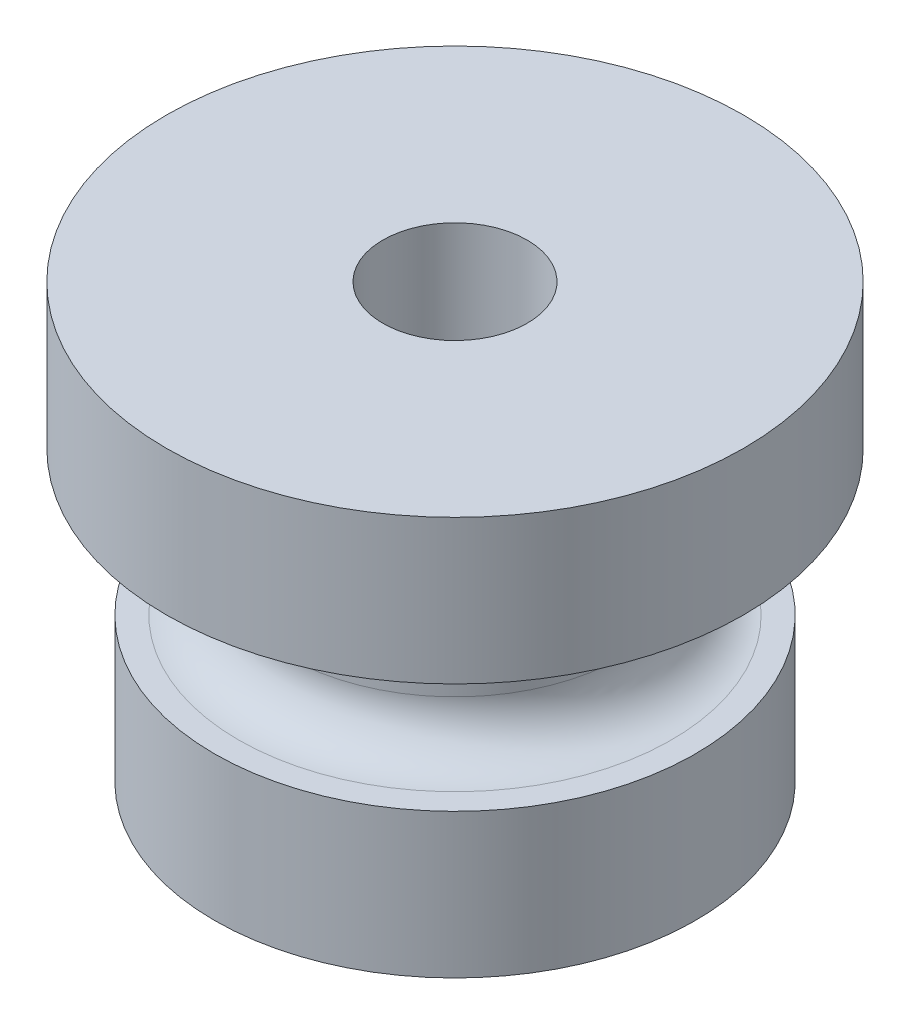
ISO-10303-21;
HEADER;
FILE_DESCRIPTION(('STEP AP214'),'2;1');
FILE_NAME('part.step','',(''),(''),'','','');
FILE_SCHEMA(('AUTOMOTIVE_DESIGN { 1 0 10303 214 1 1 1 1 }'));
ENDSEC;
DATA;
#1=APPLICATION_CONTEXT('core data for automotive mechanical design processes');
#2=APPLICATION_PROTOCOL_DEFINITION('international standard','automotive_design',2000,#1);
#3=PRODUCT_CONTEXT('',#1,'mechanical');
#4=PRODUCT('Part','Part','',(#3));
#5=PRODUCT_RELATED_PRODUCT_CATEGORY('part','',(#4));
#6=PRODUCT_DEFINITION_FORMATION('','',#4);
#7=PRODUCT_DEFINITION_CONTEXT('part definition',#1,'design');
#8=PRODUCT_DEFINITION('design','',#6,#7);
#9=PRODUCT_DEFINITION_SHAPE('','',#8);
#10=(LENGTH_UNIT() NAMED_UNIT(*) SI_UNIT(.MILLI.,.METRE.));
#11=(NAMED_UNIT(*) PLANE_ANGLE_UNIT() SI_UNIT($,.RADIAN.));
#12=(NAMED_UNIT(*) SI_UNIT($,.STERADIAN.) SOLID_ANGLE_UNIT());
#13=UNCERTAINTY_MEASURE_WITH_UNIT(LENGTH_MEASURE(1.E-05),#10,'distance_accuracy_value','');
#14=(GEOMETRIC_REPRESENTATION_CONTEXT(3) GLOBAL_UNCERTAINTY_ASSIGNED_CONTEXT((#13)) GLOBAL_UNIT_ASSIGNED_CONTEXT((#10,
#11,#12)) REPRESENTATION_CONTEXT('',''));
#15=CARTESIAN_POINT('',(0.,0.,0.));
#16=DIRECTION('',(0.,0.,1.));
#17=DIRECTION('',(1.,0.,0.));
#18=AXIS2_PLACEMENT_3D('',#15,#16,#17);
#19=CARTESIAN_POINT('',(0.,9.,0.));
#20=DIRECTION('',(0.,-1.,0.));
#21=DIRECTION('',(0.,0.,1.));
#22=AXIS2_PLACEMENT_3D('',#19,#20,#21);
#23=CYLINDRICAL_SURFACE('',#22,3.5);
#24=CARTESIAN_POINT('',(0.,4.,0.));
#25=DIRECTION('',(0.,1.,0.));
#26=DIRECTION('',(0.,0.,1.));
#27=AXIS2_PLACEMENT_3D('',#24,#25,#26);
#28=CIRCLE('',#27,3.5);
#29=CARTESIAN_POINT('',(0.,4.,3.5));
#30=VERTEX_POINT('',#29);
#31=EDGE_CURVE('E46',#30,#30,#28,.F.);
#32=ORIENTED_EDGE('',*,*,#31,.F.);
#33=EDGE_LOOP('',(#32));
#34=FACE_BOUND('',#33,.T.);
#35=CARTESIAN_POINT('',(0.,5.,0.));
#36=DIRECTION('',(0.,-1.,0.));
#37=DIRECTION('',(0.,0.,-1.));
#38=AXIS2_PLACEMENT_3D('',#35,#36,#37);
#39=CIRCLE('',#38,3.5);
#40=CARTESIAN_POINT('',(0.,5.,-3.5));
#41=VERTEX_POINT('',#40);
#42=EDGE_CURVE('E50',#41,#41,#39,.F.);
#43=ORIENTED_EDGE('',*,*,#42,.F.);
#44=EDGE_LOOP('',(#43));
#45=FACE_BOUND('',#44,.T.);
#46=ADVANCED_FACE('F39',(#34,#45),#23,.T.);
#47=CARTESIAN_POINT('',(0.,9.,0.));
#48=DIRECTION('',(0.,1.,0.));
#49=DIRECTION('',(0.,0.,-1.));
#50=AXIS2_PLACEMENT_3D('',#47,#48,#49);
#51=PLANE('',#50);
#52=CARTESIAN_POINT('',(0.,9.,0.));
#53=DIRECTION('',(0.,-1.,0.));
#54=DIRECTION('',(0.,0.,-1.));
#55=AXIS2_PLACEMENT_3D('',#52,#53,#54);
#56=CIRCLE('',#55,1.5);
#57=CARTESIAN_POINT('',(0.,9.,-1.5));
#58=VERTEX_POINT('',#57);
#59=EDGE_CURVE('E59',#58,#58,#56,.T.);
#60=ORIENTED_EDGE('',*,*,#59,.T.);
#61=EDGE_LOOP('',(#60));
#62=FACE_BOUND('',#61,.T.);
#63=CARTESIAN_POINT('',(0.,9.,0.));
#64=DIRECTION('',(0.,-1.,0.));
#65=DIRECTION('',(0.,0.,-1.));
#66=AXIS2_PLACEMENT_3D('',#63,#64,#65);
#67=CIRCLE('',#66,6.);
#68=CARTESIAN_POINT('',(0.,9.,-6.));
#69=VERTEX_POINT('',#68);
#70=EDGE_CURVE('E66',#69,#69,#67,.T.);
#71=ORIENTED_EDGE('',*,*,#70,.F.);
#72=EDGE_LOOP('',(#71));
#73=FACE_BOUND('',#72,.T.);
#74=ADVANCED_FACE('F90',(#62,#73),#51,.T.);
#75=CARTESIAN_POINT('',(0.,0.,0.));
#76=DIRECTION('',(0.,1.,0.));
#77=DIRECTION('',(0.,0.,-1.));
#78=AXIS2_PLACEMENT_3D('',#75,#76,#77);
#79=PLANE('',#78);
#80=CARTESIAN_POINT('',(0.,0.,0.));
#81=DIRECTION('',(0.,-1.,0.));
#82=DIRECTION('',(0.,0.,-1.));
#83=AXIS2_PLACEMENT_3D('',#80,#81,#82);
#84=CIRCLE('',#83,1.5);
#85=CARTESIAN_POINT('',(0.,0.,-1.5));
#86=VERTEX_POINT('',#85);
#87=EDGE_CURVE('E60',#86,#86,#84,.T.);
#88=ORIENTED_EDGE('',*,*,#87,.F.);
#89=EDGE_LOOP('',(#88));
#90=FACE_BOUND('',#89,.T.);
#91=CARTESIAN_POINT('',(0.,0.,0.));
#92=DIRECTION('',(0.,1.,0.));
#93=DIRECTION('',(0.,0.,1.));
#94=AXIS2_PLACEMENT_3D('',#91,#92,#93);
#95=CIRCLE('',#94,5.);
#96=CARTESIAN_POINT('',(0.,0.,5.));
#97=VERTEX_POINT('',#96);
#98=EDGE_CURVE('E72',#97,#97,#95,.T.);
#99=ORIENTED_EDGE('',*,*,#98,.F.);
#100=EDGE_LOOP('',(#99));
#101=FACE_BOUND('',#100,.T.);
#102=ADVANCED_FACE('F87',(#90,#101),#79,.F.);
#103=CARTESIAN_POINT('',(0.,9.,0.));
#104=DIRECTION('',(0.,-1.,0.));
#105=DIRECTION('',(0.,0.,1.));
#106=AXIS2_PLACEMENT_3D('',#103,#104,#105);
#107=CYLINDRICAL_SURFACE('',#106,1.5);
#108=ORIENTED_EDGE('',*,*,#87,.T.);
#109=EDGE_LOOP('',(#108));
#110=FACE_BOUND('',#109,.T.);
#111=ORIENTED_EDGE('',*,*,#59,.F.);
#112=EDGE_LOOP('',(#111));
#113=FACE_BOUND('',#112,.T.);
#114=ADVANCED_FACE('F89',(#110,#113),#107,.F.);
#115=CARTESIAN_POINT('',(0.,6.,0.));
#116=DIRECTION('',(0.,1.,0.));
#117=DIRECTION('',(0.,0.,-1.));
#118=AXIS2_PLACEMENT_3D('',#115,#116,#117);
#119=PLANE('',#118);
#120=CARTESIAN_POINT('',(0.,6.,0.));
#121=DIRECTION('',(0.,-1.,0.));
#122=DIRECTION('',(0.,0.,-1.));
#123=AXIS2_PLACEMENT_3D('',#120,#121,#122);
#124=CIRCLE('',#123,4.5);
#125=CARTESIAN_POINT('',(0.,6.,-4.5));
#126=VERTEX_POINT('',#125);
#127=EDGE_CURVE('E10',#126,#126,#124,.T.);
#128=ORIENTED_EDGE('',*,*,#127,.F.);
#129=EDGE_LOOP('',(#128));
#130=FACE_BOUND('',#129,.T.);
#131=CARTESIAN_POINT('',(0.,6.,0.));
#132=DIRECTION('',(0.,-1.,0.));
#133=DIRECTION('',(0.,0.,-1.));
#134=AXIS2_PLACEMENT_3D('',#131,#132,#133);
#135=CIRCLE('',#134,6.);
#136=CARTESIAN_POINT('',(0.,6.,-6.));
#137=VERTEX_POINT('',#136);
#138=EDGE_CURVE('E63',#137,#137,#135,.T.);
#139=ORIENTED_EDGE('',*,*,#138,.T.);
#140=EDGE_LOOP('',(#139));
#141=FACE_BOUND('',#140,.T.);
#142=ADVANCED_FACE('F97',(#130,#141),#119,.F.);
#143=CARTESIAN_POINT('',(0.,6.,0.));
#144=DIRECTION('',(0.,1.,0.));
#145=DIRECTION('',(0.,0.,-1.));
#146=AXIS2_PLACEMENT_3D('',#143,#144,#145);
#147=CYLINDRICAL_SURFACE('',#146,6.);
#148=ORIENTED_EDGE('',*,*,#138,.F.);
#149=EDGE_LOOP('',(#148));
#150=FACE_BOUND('',#149,.T.);
#151=ORIENTED_EDGE('',*,*,#70,.T.);
#152=EDGE_LOOP('',(#151));
#153=FACE_BOUND('',#152,.T.);
#154=ADVANCED_FACE('F118',(#150,#153),#147,.T.);
#155=CARTESIAN_POINT('',(0.,3.,0.));
#156=DIRECTION('',(0.,-1.,0.));
#157=DIRECTION('',(0.,0.,1.));
#158=AXIS2_PLACEMENT_3D('',#155,#156,#157);
#159=PLANE('',#158);
#160=CARTESIAN_POINT('',(0.,3.,0.));
#161=DIRECTION('',(0.,1.,0.));
#162=DIRECTION('',(0.,0.,1.));
#163=AXIS2_PLACEMENT_3D('',#160,#161,#162);
#164=CIRCLE('',#163,4.5);
#165=CARTESIAN_POINT('',(0.,3.,4.5));
#166=VERTEX_POINT('',#165);
#167=EDGE_CURVE('E54',#166,#166,#164,.T.);
#168=ORIENTED_EDGE('',*,*,#167,.F.);
#169=EDGE_LOOP('',(#168));
#170=FACE_BOUND('',#169,.T.);
#171=CARTESIAN_POINT('',(0.,3.,0.));
#172=DIRECTION('',(0.,1.,0.));
#173=DIRECTION('',(0.,0.,1.));
#174=AXIS2_PLACEMENT_3D('',#171,#172,#173);
#175=CIRCLE('',#174,5.);
#176=CARTESIAN_POINT('',(0.,3.,5.));
#177=VERTEX_POINT('',#176);
#178=EDGE_CURVE('E69',#177,#177,#175,.T.);
#179=ORIENTED_EDGE('',*,*,#178,.T.);
#180=EDGE_LOOP('',(#179));
#181=FACE_BOUND('',#180,.T.);
#182=ADVANCED_FACE('F78',(#170,#181),#159,.F.);
#183=CARTESIAN_POINT('',(0.,3.,0.));
#184=DIRECTION('',(0.,-1.,0.));
#185=DIRECTION('',(0.,0.,1.));
#186=AXIS2_PLACEMENT_3D('',#183,#184,#185);
#187=CYLINDRICAL_SURFACE('',#186,5.);
#188=ORIENTED_EDGE('',*,*,#178,.F.);
#189=EDGE_LOOP('',(#188));
#190=FACE_BOUND('',#189,.T.);
#191=ORIENTED_EDGE('',*,*,#98,.T.);
#192=EDGE_LOOP('',(#191));
#193=FACE_BOUND('',#192,.T.);
#194=ADVANCED_FACE('F80',(#190,#193),#187,.T.);
#195=CARTESIAN_POINT('',(0.,4.,0.));
#196=DIRECTION('',(0.,-1.,0.));
#197=DIRECTION('',(0.,0.,1.));
#198=AXIS2_PLACEMENT_3D('',#195,#196,#197);
#199=TOROIDAL_SURFACE('',#198,4.5,1.);
#200=ORIENTED_EDGE('',*,*,#31,.T.);
#201=EDGE_LOOP('',(#200));
#202=FACE_BOUND('',#201,.T.);
#203=ORIENTED_EDGE('',*,*,#167,.T.);
#204=EDGE_LOOP('',(#203));
#205=FACE_BOUND('',#204,.T.);
#206=ADVANCED_FACE('F83',(#202,#205),#199,.F.);
#207=CARTESIAN_POINT('',(0.,5.,0.));
#208=DIRECTION('',(0.,1.,0.));
#209=DIRECTION('',(0.,0.,-1.));
#210=AXIS2_PLACEMENT_3D('',#207,#208,#209);
#211=TOROIDAL_SURFACE('',#210,4.5,1.);
#212=ORIENTED_EDGE('',*,*,#42,.T.);
#213=EDGE_LOOP('',(#212));
#214=FACE_BOUND('',#213,.T.);
#215=ORIENTED_EDGE('',*,*,#127,.T.);
#216=EDGE_LOOP('',(#215));
#217=FACE_BOUND('',#216,.T.);
#218=ADVANCED_FACE('F41',(#214,#217),#211,.F.);
#219=CLOSED_SHELL('',(#46,#74,#102,#114,#142,#154,#182,#194,#206,#218));
#220=MANIFOLD_SOLID_BREP('B2',#219);
#221=ADVANCED_BREP_SHAPE_REPRESENTATION('',(#18,#220),#14);
#222=SHAPE_DEFINITION_REPRESENTATION(#9,#221);
ENDSEC;
END-ISO-10303-21;
